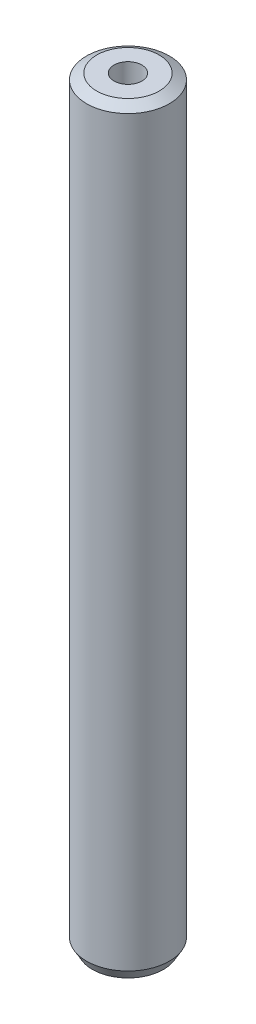
ISO-10303-21;
HEADER;
FILE_DESCRIPTION(('STEP AP214'),'2;1');
FILE_NAME('part.step','',(''),(''),'','','');
FILE_SCHEMA(('AUTOMOTIVE_DESIGN { 1 0 10303 214 1 1 1 1 }'));
ENDSEC;
DATA;
#1=APPLICATION_CONTEXT('core data for automotive mechanical design processes');
#2=APPLICATION_PROTOCOL_DEFINITION('international standard','automotive_design',2000,#1);
#3=PRODUCT_CONTEXT('',#1,'mechanical');
#4=PRODUCT('Part','Part','',(#3));
#5=PRODUCT_RELATED_PRODUCT_CATEGORY('part','',(#4));
#6=PRODUCT_DEFINITION_FORMATION('','',#4);
#7=PRODUCT_DEFINITION_CONTEXT('part definition',#1,'design');
#8=PRODUCT_DEFINITION('design','',#6,#7);
#9=PRODUCT_DEFINITION_SHAPE('','',#8);
#10=(LENGTH_UNIT() NAMED_UNIT(*) SI_UNIT(.MILLI.,.METRE.));
#11=(NAMED_UNIT(*) PLANE_ANGLE_UNIT() SI_UNIT($,.RADIAN.));
#12=(NAMED_UNIT(*) SI_UNIT($,.STERADIAN.) SOLID_ANGLE_UNIT());
#13=UNCERTAINTY_MEASURE_WITH_UNIT(LENGTH_MEASURE(1.E-05),#10,'distance_accuracy_value','');
#14=(GEOMETRIC_REPRESENTATION_CONTEXT(3) GLOBAL_UNCERTAINTY_ASSIGNED_CONTEXT((#13)) GLOBAL_UNIT_ASSIGNED_CONTEXT((#10,
#11,#12)) REPRESENTATION_CONTEXT('',''));
#15=CARTESIAN_POINT('',(0.,0.,0.));
#16=DIRECTION('',(0.,0.,1.));
#17=DIRECTION('',(1.,0.,0.));
#18=AXIS2_PLACEMENT_3D('',#15,#16,#17);
#19=CARTESIAN_POINT('',(0.,412.221045887825,0.));
#20=DIRECTION('',(0.,-1.,0.));
#21=DIRECTION('',(0.,0.,-1.));
#22=AXIS2_PLACEMENT_3D('',#19,#20,#21);
#23=CYLINDRICAL_SURFACE('',#22,22.5);
#24=CARTESIAN_POINT('',(0.,409.029847269234,0.));
#25=DIRECTION('',(0.,1.,0.));
#26=DIRECTION('',(0.,0.,1.));
#27=AXIS2_PLACEMENT_3D('',#24,#25,#26);
#28=CIRCLE('',#27,22.5);
#29=CARTESIAN_POINT('',(0.,409.029847269234,22.5));
#30=VERTEX_POINT('',#29);
#31=EDGE_CURVE('E50',#30,#30,#28,.F.);
#32=ORIENTED_EDGE('',*,*,#31,.T.);
#33=EDGE_LOOP('',(#32));
#34=FACE_BOUND('',#33,.T.);
#35=CARTESIAN_POINT('',(0.,5.52731814444468,0.));
#36=DIRECTION('',(0.,1.,0.));
#37=DIRECTION('',(0.,0.,1.));
#38=AXIS2_PLACEMENT_3D('',#35,#36,#37);
#39=CIRCLE('',#38,22.5);
#40=CARTESIAN_POINT('',(0.,5.52731814444468,22.5));
#41=VERTEX_POINT('',#40);
#42=EDGE_CURVE('E51',#41,#41,#39,.T.);
#43=ORIENTED_EDGE('',*,*,#42,.T.);
#44=EDGE_LOOP('',(#43));
#45=FACE_BOUND('',#44,.T.);
#46=ADVANCED_FACE('F39',(#34,#45),#23,.T.);
#47=CARTESIAN_POINT('',(0.,412.221045887825,0.));
#48=DIRECTION('',(0.,1.,0.));
#49=DIRECTION('',(0.,0.,1.));
#50=AXIS2_PLACEMENT_3D('',#47,#48,#49);
#51=PLANE('',#50);
#52=CARTESIAN_POINT('',(0.,412.221045887825,0.));
#53=DIRECTION('',(0.,1.,0.));
#54=DIRECTION('',(0.,0.,1.));
#55=AXIS2_PLACEMENT_3D('',#52,#53,#54);
#56=CIRCLE('',#55,16.9726818555554);
#57=CARTESIAN_POINT('',(0.,412.221045887825,16.9726818555554));
#58=VERTEX_POINT('',#57);
#59=EDGE_CURVE('E54',#58,#58,#56,.T.);
#60=ORIENTED_EDGE('',*,*,#59,.T.);
#61=EDGE_LOOP('',(#60));
#62=FACE_BOUND('',#61,.T.);
#63=CARTESIAN_POINT('',(0.,412.221045887825,0.));
#64=DIRECTION('',(0.,1.,0.));
#65=DIRECTION('',(0.,0.,1.));
#66=AXIS2_PLACEMENT_3D('',#63,#64,#65);
#67=CIRCLE('',#66,7.56681124533411);
#68=CARTESIAN_POINT('',(0.,412.221045887825,7.56681124533411));
#69=VERTEX_POINT('',#68);
#70=EDGE_CURVE('E58',#69,#69,#67,.T.);
#71=ORIENTED_EDGE('',*,*,#70,.F.);
#72=EDGE_LOOP('',(#71));
#73=FACE_BOUND('',#72,.T.);
#74=ADVANCED_FACE('F69',(#62,#73),#51,.T.);
#75=CARTESIAN_POINT('',(0.,0.,0.));
#76=DIRECTION('',(0.,1.,0.));
#77=DIRECTION('',(0.,0.,1.));
#78=AXIS2_PLACEMENT_3D('',#75,#76,#77);
#79=PLANE('',#78);
#80=CARTESIAN_POINT('',(0.,0.,0.));
#81=DIRECTION('',(0.,1.,0.));
#82=DIRECTION('',(0.,0.,1.));
#83=AXIS2_PLACEMENT_3D('',#80,#81,#82);
#84=CIRCLE('',#83,19.3088013814081);
#85=CARTESIAN_POINT('',(0.,0.,19.3088013814081));
#86=VERTEX_POINT('',#85);
#87=EDGE_CURVE('E10',#86,#86,#84,.F.);
#88=ORIENTED_EDGE('',*,*,#87,.T.);
#89=EDGE_LOOP('',(#88));
#90=FACE_BOUND('',#89,.T.);
#91=CARTESIAN_POINT('',(0.,0.,0.));
#92=DIRECTION('',(0.,1.,0.));
#93=DIRECTION('',(0.,0.,1.));
#94=AXIS2_PLACEMENT_3D('',#91,#92,#93);
#95=CIRCLE('',#94,7.56681124533411);
#96=CARTESIAN_POINT('',(0.,0.,7.56681124533411));
#97=VERTEX_POINT('',#96);
#98=EDGE_CURVE('E63',#97,#97,#95,.T.);
#99=ORIENTED_EDGE('',*,*,#98,.T.);
#100=EDGE_LOOP('',(#99));
#101=FACE_BOUND('',#100,.T.);
#102=ADVANCED_FACE('F75',(#90,#101),#79,.F.);
#103=CARTESIAN_POINT('',(0.,412.221045887825,0.));
#104=DIRECTION('',(0.,-1.,0.));
#105=DIRECTION('',(0.,0.,-1.));
#106=AXIS2_PLACEMENT_3D('',#103,#104,#105);
#107=CYLINDRICAL_SURFACE('',#106,7.56681124533411);
#108=ORIENTED_EDGE('',*,*,#70,.T.);
#109=EDGE_LOOP('',(#108));
#110=FACE_BOUND('',#109,.T.);
#111=ORIENTED_EDGE('',*,*,#98,.F.);
#112=EDGE_LOOP('',(#111));
#113=FACE_BOUND('',#112,.T.);
#114=ADVANCED_FACE('F70',(#110,#113),#107,.F.);
#115=CARTESIAN_POINT('',(0.,412.221045887825,0.));
#116=DIRECTION('',(0.,-1.,0.));
#117=DIRECTION('',(0.,0.,-1.));
#118=AXIS2_PLACEMENT_3D('',#115,#116,#117);
#119=CONICAL_SURFACE('',#118,16.9726818555554,1.04719755119659);
#120=ORIENTED_EDGE('',*,*,#31,.F.);
#121=EDGE_LOOP('',(#120));
#122=FACE_BOUND('',#121,.T.);
#123=ORIENTED_EDGE('',*,*,#59,.F.);
#124=EDGE_LOOP('',(#123));
#125=FACE_BOUND('',#124,.T.);
#126=ADVANCED_FACE('F81',(#122,#125),#119,.T.);
#127=CARTESIAN_POINT('',(0.,5.52731814444468,0.));
#128=DIRECTION('',(0.,1.,0.));
#129=DIRECTION('',(0.,0.,1.));
#130=AXIS2_PLACEMENT_3D('',#127,#128,#129);
#131=CONICAL_SURFACE('',#130,22.5,0.523598775598305);
#132=ORIENTED_EDGE('',*,*,#87,.F.);
#133=EDGE_LOOP('',(#132));
#134=FACE_BOUND('',#133,.T.);
#135=ORIENTED_EDGE('',*,*,#42,.F.);
#136=EDGE_LOOP('',(#135));
#137=FACE_BOUND('',#136,.T.);
#138=ADVANCED_FACE('F45',(#134,#137),#131,.T.);
#139=CLOSED_SHELL('',(#46,#74,#102,#114,#126,#138));
#140=MANIFOLD_SOLID_BREP('B2',#139);
#141=ADVANCED_BREP_SHAPE_REPRESENTATION('',(#18,#140),#14);
#142=SHAPE_DEFINITION_REPRESENTATION(#9,#141);
ENDSEC;
END-ISO-10303-21;
